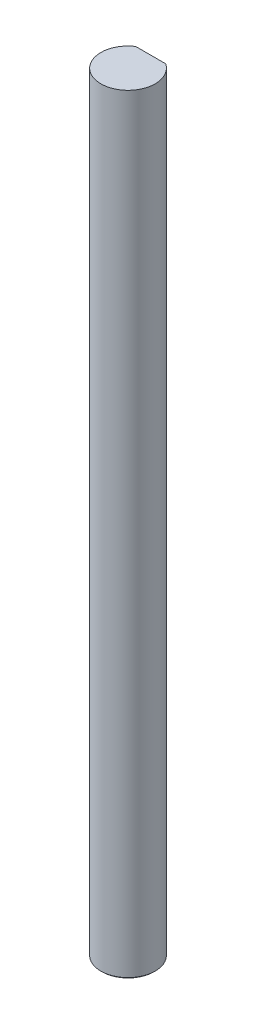
ISO-10303-21;
HEADER;
FILE_DESCRIPTION(('STEP AP214'),'2;1');
FILE_NAME('part.step','',(''),(''),'','','');
FILE_SCHEMA(('AUTOMOTIVE_DESIGN { 1 0 10303 214 1 1 1 1 }'));
ENDSEC;
DATA;
#1=APPLICATION_CONTEXT('core data for automotive mechanical design processes');
#2=APPLICATION_PROTOCOL_DEFINITION('international standard','automotive_design',2000,#1);
#3=PRODUCT_CONTEXT('',#1,'mechanical');
#4=PRODUCT('Part','Part','',(#3));
#5=PRODUCT_RELATED_PRODUCT_CATEGORY('part','',(#4));
#6=PRODUCT_DEFINITION_FORMATION('','',#4);
#7=PRODUCT_DEFINITION_CONTEXT('part definition',#1,'design');
#8=PRODUCT_DEFINITION('design','',#6,#7);
#9=PRODUCT_DEFINITION_SHAPE('','',#8);
#10=(LENGTH_UNIT() NAMED_UNIT(*) SI_UNIT(.MILLI.,.METRE.));
#11=(NAMED_UNIT(*) PLANE_ANGLE_UNIT() SI_UNIT($,.RADIAN.));
#12=(NAMED_UNIT(*) SI_UNIT($,.STERADIAN.) SOLID_ANGLE_UNIT());
#13=UNCERTAINTY_MEASURE_WITH_UNIT(LENGTH_MEASURE(1.E-05),#10,'distance_accuracy_value','');
#14=(GEOMETRIC_REPRESENTATION_CONTEXT(3) GLOBAL_UNCERTAINTY_ASSIGNED_CONTEXT((#13)) GLOBAL_UNIT_ASSIGNED_CONTEXT((#10,
#11,#12)) REPRESENTATION_CONTEXT('',''));
#15=CARTESIAN_POINT('',(0.,0.,0.));
#16=DIRECTION('',(0.,0.,1.));
#17=DIRECTION('',(1.,0.,0.));
#18=AXIS2_PLACEMENT_3D('',#15,#16,#17);
#19=CARTESIAN_POINT('',(0.,90.,-2.5));
#20=DIRECTION('',(0.,0.,-1.));
#21=DIRECTION('',(0.,-1.,0.));
#22=AXIS2_PLACEMENT_3D('',#19,#20,#21);
#23=PLANE('',#22);
#24=DIRECTION('',(0.,-1.,0.));
#25=VECTOR('',#24,1.);
#26=CARTESIAN_POINT('',(-1.6583123951777,90.,-2.5));
#27=LINE('',#26,#25);
#28=CARTESIAN_POINT('',(-1.6583123951777,85.,-2.5));
#29=VERTEX_POINT('',#28);
#30=CARTESIAN_POINT('',(-1.6583123951777,0.125000000000083,-2.5));
#31=VERTEX_POINT('',#30);
#32=EDGE_CURVE('E101',#29,#31,#27,.T.);
#33=ORIENTED_EDGE('',*,*,#32,.F.);
#34=DIRECTION('',(1.,0.,0.));
#35=VECTOR('',#34,1.);
#36=CARTESIAN_POINT('',(0.,85.,-2.5));
#37=LINE('',#36,#35);
#38=CARTESIAN_POINT('',(1.6583123951777,85.,-2.5));
#39=VERTEX_POINT('',#38);
#40=EDGE_CURVE('E61',#29,#39,#37,.T.);
#41=ORIENTED_EDGE('',*,*,#40,.T.);
#42=DIRECTION('',(0.,-1.,0.));
#43=VECTOR('',#42,1.);
#44=CARTESIAN_POINT('',(1.6583123951777,90.,-2.5));
#45=LINE('',#44,#43);
#46=CARTESIAN_POINT('',(1.6583123951777,0.125000000000083,-2.5));
#47=VERTEX_POINT('',#46);
#48=EDGE_CURVE('E99',#39,#47,#45,.T.);
#49=ORIENTED_EDGE('',*,*,#48,.T.);
#50=CARTESIAN_POINT('',(1.6583123951777,0.125000000000083,-2.5));
#51=CARTESIAN_POINT('',(1.57973572193472,0.0815651095965014,-2.5));
#52=CARTESIAN_POINT('',(1.50022900034232,0.0397533035352935,-2.5));
#53=CARTESIAN_POINT('',(1.41972708644996,0.,-2.5));
#54=(BOUNDED_CURVE() B_SPLINE_CURVE(3,(#50,#51,#52,#53),.UNSPECIFIED.,.F.,
.F.) B_SPLINE_CURVE_WITH_KNOTS((4,4),(0.,0.000269347265701222),
.UNSPECIFIED.) CURVE() GEOMETRIC_REPRESENTATION_ITEM() RATIONAL_B_SPLINE_CURVE((1.,1.,1.,1.)) REPRESENTATION_ITEM(''));
#55=CARTESIAN_POINT('',(1.41972708644996,0.,-2.5));
#56=VERTEX_POINT('',#55);
#57=EDGE_CURVE('E109',#47,#56,#54,.T.);
#58=ORIENTED_EDGE('',*,*,#57,.T.);
#59=DIRECTION('',(1.,0.,0.));
#60=VECTOR('',#59,1.);
#61=CARTESIAN_POINT('',(0.,0.,-2.5));
#62=LINE('',#61,#60);
#63=CARTESIAN_POINT('',(-1.41972708644996,0.,-2.5));
#64=VERTEX_POINT('',#63);
#65=EDGE_CURVE('E115',#64,#56,#62,.T.);
#66=ORIENTED_EDGE('',*,*,#65,.F.);
#67=CARTESIAN_POINT('',(-1.41972708644996,0.,-2.5));
#68=CARTESIAN_POINT('',(-1.50022900034231,0.0397533035353176,-2.5));
#69=CARTESIAN_POINT('',(-1.57973572193473,0.0815651095964891,-2.5));
#70=CARTESIAN_POINT('',(-1.6583123951777,0.125000000000083,-2.5));
#71=(BOUNDED_CURVE() B_SPLINE_CURVE(3,(#67,#68,#69,#70),.UNSPECIFIED.,.F.,
.F.) B_SPLINE_CURVE_WITH_KNOTS((4,4),(0.,0.000269347265701236),
.UNSPECIFIED.) CURVE() GEOMETRIC_REPRESENTATION_ITEM() RATIONAL_B_SPLINE_CURVE((1.,1.,1.,1.)) REPRESENTATION_ITEM(''));
#72=EDGE_CURVE('E139',#64,#31,#71,.T.);
#73=ORIENTED_EDGE('',*,*,#72,.T.);
#74=EDGE_LOOP('',(#33,#41,#49,#58,#66,#73));
#75=FACE_BOUND('',#74,.T.);
#76=ADVANCED_FACE('F47',(#75),#23,.T.);
#77=CARTESIAN_POINT('',(0.,90.,0.));
#78=DIRECTION('',(0.,-1.,0.));
#79=DIRECTION('',(0.,0.,-1.));
#80=AXIS2_PLACEMENT_3D('',#77,#78,#79);
#81=CYLINDRICAL_SURFACE('',#80,3.);
#82=ORIENTED_EDGE('',*,*,#48,.F.);
#83=CARTESIAN_POINT('',(0.,85.,0.));
#84=DIRECTION('',(0.,1.,0.));
#85=DIRECTION('',(0.,0.,1.));
#86=AXIS2_PLACEMENT_3D('',#83,#84,#85);
#87=CIRCLE('',#86,3.);
#88=EDGE_CURVE('E11',#39,#29,#87,.F.);
#89=ORIENTED_EDGE('',*,*,#88,.T.);
#90=ORIENTED_EDGE('',*,*,#32,.T.);
#91=CARTESIAN_POINT('',(0.,0.125000000000056,0.));
#92=DIRECTION('',(0.,1.,0.));
#93=DIRECTION('',(0.,0.,1.));
#94=AXIS2_PLACEMENT_3D('',#91,#92,#93);
#95=CIRCLE('',#94,3.);
#96=CARTESIAN_POINT('',(0.,0.125000000000056,3.));
#97=VERTEX_POINT('',#96);
#98=EDGE_CURVE('E135',#31,#97,#95,.T.);
#99=ORIENTED_EDGE('',*,*,#98,.T.);
#100=CARTESIAN_POINT('',(0.,0.125000000000056,0.));
#101=DIRECTION('',(0.,1.,0.));
#102=DIRECTION('',(0.,0.,1.));
#103=AXIS2_PLACEMENT_3D('',#100,#101,#102);
#104=CIRCLE('',#103,3.);
#105=EDGE_CURVE('E107',#97,#47,#104,.T.);
#106=ORIENTED_EDGE('',*,*,#105,.T.);
#107=EDGE_LOOP('',(#82,#89,#90,#99,#106));
#108=FACE_BOUND('',#107,.T.);
#109=ADVANCED_FACE('F105',(#108),#81,.T.);
#110=CARTESIAN_POINT('',(0.,0.125000000000056,0.));
#111=DIRECTION('',(0.,1.,0.));
#112=DIRECTION('',(0.,0.,1.));
#113=AXIS2_PLACEMENT_3D('',#110,#111,#112);
#114=CONICAL_SURFACE('',#113,3.,0.785398163397442);
#115=DIRECTION('',(0.,0.707106781186553,0.707106781186543));
#116=VECTOR('',#115,1.);
#117=CARTESIAN_POINT('',(0.,0.125000000000056,3.));
#118=LINE('',#117,#116);
#119=CARTESIAN_POINT('',(0.,0.,2.87499999999994));
#120=VERTEX_POINT('',#119);
#121=EDGE_CURVE('E131',#120,#97,#118,.T.);
#122=ORIENTED_EDGE('',*,*,#121,.F.);
#123=CARTESIAN_POINT('',(0.,0.,0.));
#124=DIRECTION('',(0.,-1.,0.));
#125=DIRECTION('',(0.,0.,1.));
#126=AXIS2_PLACEMENT_3D('',#123,#124,#125);
#127=CIRCLE('',#126,2.87499999999994);
#128=EDGE_CURVE('E55',#56,#120,#127,.T.);
#129=ORIENTED_EDGE('',*,*,#128,.F.);
#130=ORIENTED_EDGE('',*,*,#57,.F.);
#131=ORIENTED_EDGE('',*,*,#105,.F.);
#132=EDGE_LOOP('',(#122,#129,#130,#131));
#133=FACE_BOUND('',#132,.T.);
#134=ADVANCED_FACE('F49',(#133),#114,.T.);
#135=CARTESIAN_POINT('',(0.,0.,0.));
#136=DIRECTION('',(0.,1.,0.));
#137=DIRECTION('',(1.,0.,0.));
#138=AXIS2_PLACEMENT_3D('',#135,#136,#137);
#139=PLANE('',#138);
#140=ORIENTED_EDGE('',*,*,#65,.T.);
#141=ORIENTED_EDGE('',*,*,#128,.T.);
#142=CARTESIAN_POINT('',(0.,0.,0.));
#143=DIRECTION('',(0.,-1.,0.));
#144=DIRECTION('',(0.,0.,1.));
#145=AXIS2_PLACEMENT_3D('',#142,#143,#144);
#146=CIRCLE('',#145,2.87499999999994);
#147=EDGE_CURVE('E102',#120,#64,#146,.T.);
#148=ORIENTED_EDGE('',*,*,#147,.T.);
#149=EDGE_LOOP('',(#140,#141,#148));
#150=FACE_BOUND('',#149,.T.);
#151=ADVANCED_FACE('F128',(#150),#139,.F.);
#152=CARTESIAN_POINT('',(0.,0.125000000000056,0.));
#153=DIRECTION('',(0.,1.,0.));
#154=DIRECTION('',(0.,0.,1.));
#155=AXIS2_PLACEMENT_3D('',#152,#153,#154);
#156=CONICAL_SURFACE('',#155,3.,0.785398163397442);
#157=ORIENTED_EDGE('',*,*,#147,.F.);
#158=ORIENTED_EDGE('',*,*,#121,.T.);
#159=ORIENTED_EDGE('',*,*,#98,.F.);
#160=ORIENTED_EDGE('',*,*,#72,.F.);
#161=EDGE_LOOP('',(#157,#158,#159,#160));
#162=FACE_BOUND('',#161,.T.);
#163=ADVANCED_FACE('F138',(#162),#156,.T.);
#164=CARTESIAN_POINT('',(0.,85.,0.));
#165=DIRECTION('',(0.,1.,0.));
#166=DIRECTION('',(0.,0.,1.));
#167=AXIS2_PLACEMENT_3D('',#164,#165,#166);
#168=PLANE('',#167);
#169=ORIENTED_EDGE('',*,*,#88,.F.);
#170=ORIENTED_EDGE('',*,*,#40,.F.);
#171=EDGE_LOOP('',(#169,#170));
#172=FACE_BOUND('',#171,.T.);
#173=ADVANCED_FACE('F93',(#172),#168,.T.);
#174=CLOSED_SHELL('',(#76,#109,#134,#151,#163,#173));
#175=MANIFOLD_SOLID_BREP('B2',#174);
#176=ADVANCED_BREP_SHAPE_REPRESENTATION('',(#18,#175),#14);
#177=SHAPE_DEFINITION_REPRESENTATION(#9,#176);
ENDSEC;
END-ISO-10303-21;
